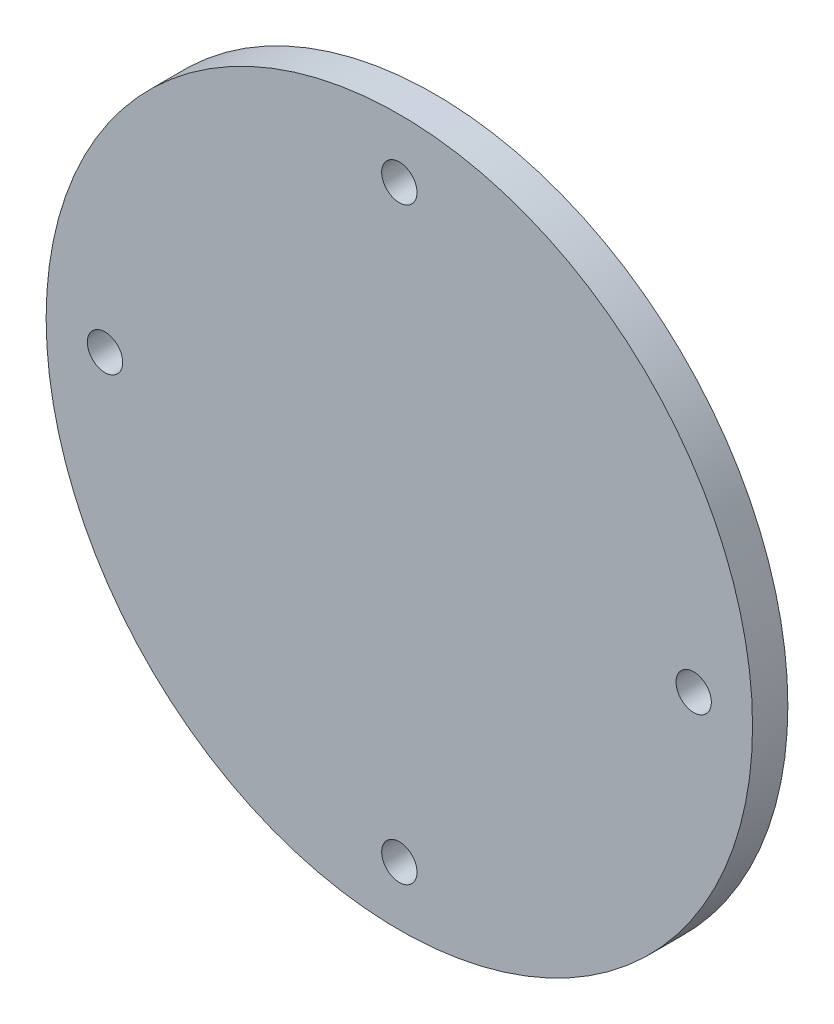
ISO-10303-21;
HEADER;
FILE_DESCRIPTION(('STEP AP214'),'2;1');
FILE_NAME('part.step','',(''),(''),'','','');
FILE_SCHEMA(('AUTOMOTIVE_DESIGN { 1 0 10303 214 1 1 1 1 }'));
ENDSEC;
DATA;
#1=APPLICATION_CONTEXT('core data for automotive mechanical design processes');
#2=APPLICATION_PROTOCOL_DEFINITION('international standard','automotive_design',2000,#1);
#3=PRODUCT_CONTEXT('',#1,'mechanical');
#4=PRODUCT('Part','Part','',(#3));
#5=PRODUCT_RELATED_PRODUCT_CATEGORY('part','',(#4));
#6=PRODUCT_DEFINITION_FORMATION('','',#4);
#7=PRODUCT_DEFINITION_CONTEXT('part definition',#1,'design');
#8=PRODUCT_DEFINITION('design','',#6,#7);
#9=PRODUCT_DEFINITION_SHAPE('','',#8);
#10=(LENGTH_UNIT() NAMED_UNIT(*) SI_UNIT(.MILLI.,.METRE.));
#11=(NAMED_UNIT(*) PLANE_ANGLE_UNIT() SI_UNIT($,.RADIAN.));
#12=(NAMED_UNIT(*) SI_UNIT($,.STERADIAN.) SOLID_ANGLE_UNIT());
#13=UNCERTAINTY_MEASURE_WITH_UNIT(LENGTH_MEASURE(1.E-05),#10,'distance_accuracy_value','');
#14=(GEOMETRIC_REPRESENTATION_CONTEXT(3) GLOBAL_UNCERTAINTY_ASSIGNED_CONTEXT((#13)) GLOBAL_UNIT_ASSIGNED_CONTEXT((#10,
#11,#12)) REPRESENTATION_CONTEXT('',''));
#15=CARTESIAN_POINT('',(0.,0.,0.));
#16=DIRECTION('',(0.,0.,1.));
#17=DIRECTION('',(1.,0.,0.));
#18=AXIS2_PLACEMENT_3D('',#15,#16,#17);
#19=CARTESIAN_POINT('',(0.,-25.,3.));
#20=DIRECTION('',(0.,0.,-1.));
#21=DIRECTION('',(-1.,0.,0.));
#22=AXIS2_PLACEMENT_3D('',#19,#20,#21);
#23=CYLINDRICAL_SURFACE('',#22,1.5);
#24=CARTESIAN_POINT('',(0.,-25.,3.));
#25=DIRECTION('',(0.,0.,1.));
#26=DIRECTION('',(1.,0.,0.));
#27=AXIS2_PLACEMENT_3D('',#24,#25,#26);
#28=CIRCLE('',#27,1.5);
#29=CARTESIAN_POINT('',(1.50000000000001,-25.,3.));
#30=VERTEX_POINT('',#29);
#31=EDGE_CURVE('E39',#30,#30,#28,.T.);
#32=ORIENTED_EDGE('',*,*,#31,.T.);
#33=EDGE_LOOP('',(#32));
#34=FACE_BOUND('',#33,.T.);
#35=CARTESIAN_POINT('',(0.,-25.,0.));
#36=DIRECTION('',(0.,0.,1.));
#37=DIRECTION('',(1.,0.,0.));
#38=AXIS2_PLACEMENT_3D('',#35,#36,#37);
#39=CIRCLE('',#38,1.5);
#40=CARTESIAN_POINT('',(1.50000000000001,-25.,0.));
#41=VERTEX_POINT('',#40);
#42=EDGE_CURVE('E56',#41,#41,#39,.T.);
#43=ORIENTED_EDGE('',*,*,#42,.F.);
#44=EDGE_LOOP('',(#43));
#45=FACE_BOUND('',#44,.T.);
#46=ADVANCED_FACE('F31',(#34,#45),#23,.F.);
#47=CARTESIAN_POINT('',(-25.,0.,3.));
#48=DIRECTION('',(0.,0.,-1.));
#49=DIRECTION('',(-1.,0.,0.));
#50=AXIS2_PLACEMENT_3D('',#47,#48,#49);
#51=CYLINDRICAL_SURFACE('',#50,1.5);
#52=CARTESIAN_POINT('',(-25.,0.,3.));
#53=DIRECTION('',(0.,0.,1.));
#54=DIRECTION('',(1.,0.,0.));
#55=AXIS2_PLACEMENT_3D('',#52,#53,#54);
#56=CIRCLE('',#55,1.5);
#57=CARTESIAN_POINT('',(-23.5,0.,3.));
#58=VERTEX_POINT('',#57);
#59=EDGE_CURVE('E44',#58,#58,#56,.T.);
#60=ORIENTED_EDGE('',*,*,#59,.T.);
#61=EDGE_LOOP('',(#60));
#62=FACE_BOUND('',#61,.T.);
#63=CARTESIAN_POINT('',(-25.,0.,0.));
#64=DIRECTION('',(0.,0.,1.));
#65=DIRECTION('',(1.,0.,0.));
#66=AXIS2_PLACEMENT_3D('',#63,#64,#65);
#67=CIRCLE('',#66,1.5);
#68=CARTESIAN_POINT('',(-23.5,0.,0.));
#69=VERTEX_POINT('',#68);
#70=EDGE_CURVE('E54',#69,#69,#67,.T.);
#71=ORIENTED_EDGE('',*,*,#70,.F.);
#72=EDGE_LOOP('',(#71));
#73=FACE_BOUND('',#72,.T.);
#74=ADVANCED_FACE('F74',(#62,#73),#51,.F.);
#75=CARTESIAN_POINT('',(0.,25.,3.));
#76=DIRECTION('',(0.,0.,-1.));
#77=DIRECTION('',(-1.,0.,0.));
#78=AXIS2_PLACEMENT_3D('',#75,#76,#77);
#79=CYLINDRICAL_SURFACE('',#78,1.5);
#80=CARTESIAN_POINT('',(0.,25.,3.));
#81=DIRECTION('',(0.,0.,1.));
#82=DIRECTION('',(1.,0.,0.));
#83=AXIS2_PLACEMENT_3D('',#80,#81,#82);
#84=CIRCLE('',#83,1.5);
#85=CARTESIAN_POINT('',(1.50000000000001,25.,3.));
#86=VERTEX_POINT('',#85);
#87=EDGE_CURVE('E65',#86,#86,#84,.T.);
#88=ORIENTED_EDGE('',*,*,#87,.T.);
#89=EDGE_LOOP('',(#88));
#90=FACE_BOUND('',#89,.T.);
#91=CARTESIAN_POINT('',(0.,25.,0.));
#92=DIRECTION('',(0.,0.,1.));
#93=DIRECTION('',(1.,0.,0.));
#94=AXIS2_PLACEMENT_3D('',#91,#92,#93);
#95=CIRCLE('',#94,1.5);
#96=CARTESIAN_POINT('',(1.50000000000001,25.,0.));
#97=VERTEX_POINT('',#96);
#98=EDGE_CURVE('E51',#97,#97,#95,.T.);
#99=ORIENTED_EDGE('',*,*,#98,.F.);
#100=EDGE_LOOP('',(#99));
#101=FACE_BOUND('',#100,.T.);
#102=ADVANCED_FACE('F92',(#90,#101),#79,.F.);
#103=CARTESIAN_POINT('',(25.,0.,3.));
#104=DIRECTION('',(0.,0.,-1.));
#105=DIRECTION('',(-1.,0.,0.));
#106=AXIS2_PLACEMENT_3D('',#103,#104,#105);
#107=CYLINDRICAL_SURFACE('',#106,1.5);
#108=CARTESIAN_POINT('',(25.,0.,3.));
#109=DIRECTION('',(0.,0.,1.));
#110=DIRECTION('',(1.,0.,0.));
#111=AXIS2_PLACEMENT_3D('',#108,#109,#110);
#112=CIRCLE('',#111,1.5);
#113=CARTESIAN_POINT('',(26.5,0.,3.));
#114=VERTEX_POINT('',#113);
#115=EDGE_CURVE('E61',#114,#114,#112,.T.);
#116=ORIENTED_EDGE('',*,*,#115,.T.);
#117=EDGE_LOOP('',(#116));
#118=FACE_BOUND('',#117,.T.);
#119=CARTESIAN_POINT('',(25.,0.,0.));
#120=DIRECTION('',(0.,0.,1.));
#121=DIRECTION('',(1.,0.,0.));
#122=AXIS2_PLACEMENT_3D('',#119,#120,#121);
#123=CIRCLE('',#122,1.5);
#124=CARTESIAN_POINT('',(26.5,0.,0.));
#125=VERTEX_POINT('',#124);
#126=EDGE_CURVE('E48',#125,#125,#123,.T.);
#127=ORIENTED_EDGE('',*,*,#126,.F.);
#128=EDGE_LOOP('',(#127));
#129=FACE_BOUND('',#128,.T.);
#130=ADVANCED_FACE('F33',(#118,#129),#107,.F.);
#131=CARTESIAN_POINT('',(0.,0.,3.));
#132=DIRECTION('',(0.,0.,-1.));
#133=DIRECTION('',(-1.,0.,0.));
#134=AXIS2_PLACEMENT_3D('',#131,#132,#133);
#135=CYLINDRICAL_SURFACE('',#134,30.);
#136=CARTESIAN_POINT('',(0.,0.,3.));
#137=DIRECTION('',(0.,0.,1.));
#138=DIRECTION('',(1.,0.,0.));
#139=AXIS2_PLACEMENT_3D('',#136,#137,#138);
#140=CIRCLE('',#139,30.);
#141=CARTESIAN_POINT('',(30.,0.,3.));
#142=VERTEX_POINT('',#141);
#143=EDGE_CURVE('E10',#142,#142,#140,.T.);
#144=ORIENTED_EDGE('',*,*,#143,.F.);
#145=EDGE_LOOP('',(#144));
#146=FACE_BOUND('',#145,.T.);
#147=CARTESIAN_POINT('',(0.,0.,0.));
#148=DIRECTION('',(0.,0.,1.));
#149=DIRECTION('',(1.,0.,0.));
#150=AXIS2_PLACEMENT_3D('',#147,#148,#149);
#151=CIRCLE('',#150,30.);
#152=CARTESIAN_POINT('',(30.,0.,0.));
#153=VERTEX_POINT('',#152);
#154=EDGE_CURVE('E35',#153,#153,#151,.T.);
#155=ORIENTED_EDGE('',*,*,#154,.T.);
#156=EDGE_LOOP('',(#155));
#157=FACE_BOUND('',#156,.T.);
#158=ADVANCED_FACE('F81',(#146,#157),#135,.T.);
#159=CARTESIAN_POINT('',(0.,0.,3.));
#160=DIRECTION('',(0.,0.,1.));
#161=DIRECTION('',(1.,0.,0.));
#162=AXIS2_PLACEMENT_3D('',#159,#160,#161);
#163=PLANE('',#162);
#164=ORIENTED_EDGE('',*,*,#115,.F.);
#165=EDGE_LOOP('',(#164));
#166=FACE_BOUND('',#165,.T.);
#167=ORIENTED_EDGE('',*,*,#87,.F.);
#168=EDGE_LOOP('',(#167));
#169=FACE_BOUND('',#168,.T.);
#170=ORIENTED_EDGE('',*,*,#59,.F.);
#171=EDGE_LOOP('',(#170));
#172=FACE_BOUND('',#171,.T.);
#173=ORIENTED_EDGE('',*,*,#31,.F.);
#174=EDGE_LOOP('',(#173));
#175=FACE_BOUND('',#174,.T.);
#176=ORIENTED_EDGE('',*,*,#143,.T.);
#177=EDGE_LOOP('',(#176));
#178=FACE_BOUND('',#177,.T.);
#179=ADVANCED_FACE('F77',(#166,#169,#172,#175,#178),#163,.T.);
#180=CARTESIAN_POINT('',(0.,0.,0.));
#181=DIRECTION('',(0.,0.,1.));
#182=DIRECTION('',(1.,0.,0.));
#183=AXIS2_PLACEMENT_3D('',#180,#181,#182);
#184=PLANE('',#183);
#185=ORIENTED_EDGE('',*,*,#126,.T.);
#186=EDGE_LOOP('',(#185));
#187=FACE_BOUND('',#186,.T.);
#188=ORIENTED_EDGE('',*,*,#98,.T.);
#189=EDGE_LOOP('',(#188));
#190=FACE_BOUND('',#189,.T.);
#191=ORIENTED_EDGE('',*,*,#70,.T.);
#192=EDGE_LOOP('',(#191));
#193=FACE_BOUND('',#192,.T.);
#194=ORIENTED_EDGE('',*,*,#42,.T.);
#195=EDGE_LOOP('',(#194));
#196=FACE_BOUND('',#195,.T.);
#197=ORIENTED_EDGE('',*,*,#154,.F.);
#198=EDGE_LOOP('',(#197));
#199=FACE_BOUND('',#198,.T.);
#200=ADVANCED_FACE('F80',(#187,#190,#193,#196,#199),#184,.F.);
#201=CLOSED_SHELL('',(#46,#74,#102,#130,#158,#179,#200));
#202=MANIFOLD_SOLID_BREP('B2',#201);
#203=ADVANCED_BREP_SHAPE_REPRESENTATION('',(#18,#202),#14);
#204=SHAPE_DEFINITION_REPRESENTATION(#9,#203);
ENDSEC;
END-ISO-10303-21;
